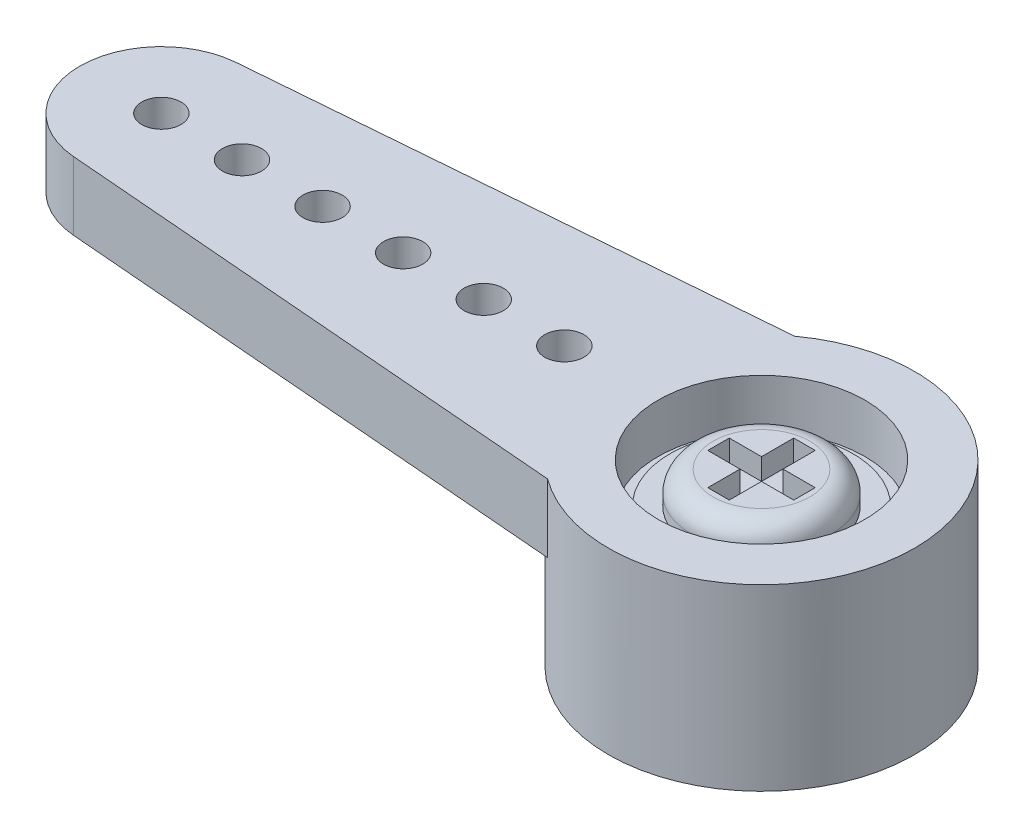
ISO-10303-21;
HEADER;
FILE_DESCRIPTION(('STEP AP214'),'2;1');
FILE_NAME('part.step','',(''),(''),'','','');
FILE_SCHEMA(('AUTOMOTIVE_DESIGN { 1 0 10303 214 1 1 1 1 }'));
ENDSEC;
DATA;
#1=APPLICATION_CONTEXT('core data for automotive mechanical design processes');
#2=APPLICATION_PROTOCOL_DEFINITION('international standard','automotive_design',2000,#1);
#3=PRODUCT_CONTEXT('',#1,'mechanical');
#4=PRODUCT('Part','Part','',(#3));
#5=PRODUCT_RELATED_PRODUCT_CATEGORY('part','',(#4));
#6=PRODUCT_DEFINITION_FORMATION('','',#4);
#7=PRODUCT_DEFINITION_CONTEXT('part definition',#1,'design');
#8=PRODUCT_DEFINITION('design','',#6,#7);
#9=PRODUCT_DEFINITION_SHAPE('','',#8);
#10=(LENGTH_UNIT() NAMED_UNIT(*) SI_UNIT(.MILLI.,.METRE.));
#11=(NAMED_UNIT(*) PLANE_ANGLE_UNIT() SI_UNIT($,.RADIAN.));
#12=(NAMED_UNIT(*) SI_UNIT($,.STERADIAN.) SOLID_ANGLE_UNIT());
#13=UNCERTAINTY_MEASURE_WITH_UNIT(LENGTH_MEASURE(1.E-05),#10,'distance_accuracy_value','');
#14=(GEOMETRIC_REPRESENTATION_CONTEXT(3) GLOBAL_UNCERTAINTY_ASSIGNED_CONTEXT((#13)) GLOBAL_UNIT_ASSIGNED_CONTEXT((#10,
#11,#12)) REPRESENTATION_CONTEXT('',''));
#15=CARTESIAN_POINT('',(0.,0.,0.));
#16=DIRECTION('',(0.,0.,1.));
#17=DIRECTION('',(1.,0.,0.));
#18=AXIS2_PLACEMENT_3D('',#15,#16,#17);
#19=CARTESIAN_POINT('',(0.,0.6604,0.));
#20=DIRECTION('',(0.,1.,0.));
#21=DIRECTION('',(0.,0.,1.));
#22=AXIS2_PLACEMENT_3D('',#19,#20,#21);
#23=PLANE('',#22);
#24=CARTESIAN_POINT('',(0.,0.6604,0.));
#25=DIRECTION('',(0.,1.,0.));
#26=DIRECTION('',(0.,0.,1.));
#27=AXIS2_PLACEMENT_3D('',#24,#25,#26);
#28=CIRCLE('',#27,2.159);
#29=CARTESIAN_POINT('',(0.,0.6604,2.159));
#30=VERTEX_POINT('',#29);
#31=EDGE_CURVE('E261',#30,#30,#28,.T.);
#32=ORIENTED_EDGE('',*,*,#31,.T.);
#33=EDGE_LOOP('',(#32));
#34=FACE_BOUND('',#33,.T.);
#35=CARTESIAN_POINT('',(0.,0.6604,0.));
#36=DIRECTION('',(0.,1.,0.));
#37=DIRECTION('',(0.,0.,1.));
#38=AXIS2_PLACEMENT_3D('',#35,#36,#37);
#39=CIRCLE('',#38,1.651);
#40=CARTESIAN_POINT('',(0.,0.6604,-1.651));
#41=VERTEX_POINT('',#40);
#42=EDGE_CURVE('E238',#41,#41,#39,.T.);
#43=ORIENTED_EDGE('',*,*,#42,.F.);
#44=EDGE_LOOP('',(#43));
#45=FACE_BOUND('',#44,.T.);
#46=ADVANCED_FACE('F31',(#34,#45),#23,.T.);
#47=CARTESIAN_POINT('',(0.,0.4572,0.));
#48=DIRECTION('',(0.,1.,0.));
#49=DIRECTION('',(0.,0.,1.));
#50=AXIS2_PLACEMENT_3D('',#47,#48,#49);
#51=PLANE('',#50);
#52=CARTESIAN_POINT('',(0.,0.4572,0.));
#53=DIRECTION('',(0.,1.,0.));
#54=DIRECTION('',(0.,0.,1.));
#55=AXIS2_PLACEMENT_3D('',#52,#53,#54);
#56=CIRCLE('',#55,2.44475);
#57=CARTESIAN_POINT('',(0.,0.4572,2.44475));
#58=VERTEX_POINT('',#57);
#59=EDGE_CURVE('E273',#58,#58,#56,.T.);
#60=ORIENTED_EDGE('',*,*,#59,.T.);
#61=EDGE_LOOP('',(#60));
#62=FACE_BOUND('',#61,.T.);
#63=CARTESIAN_POINT('',(0.,0.4572,0.));
#64=DIRECTION('',(0.,1.,0.));
#65=DIRECTION('',(0.,0.,1.));
#66=AXIS2_PLACEMENT_3D('',#63,#64,#65);
#67=CIRCLE('',#66,2.159);
#68=CARTESIAN_POINT('',(0.,0.4572,2.159));
#69=VERTEX_POINT('',#68);
#70=EDGE_CURVE('E260',#69,#69,#67,.T.);
#71=ORIENTED_EDGE('',*,*,#70,.F.);
#72=EDGE_LOOP('',(#71));
#73=FACE_BOUND('',#72,.T.);
#74=ADVANCED_FACE('F359',(#62,#73),#51,.T.);
#75=CARTESIAN_POINT('',(0.,-2.6162,0.));
#76=DIRECTION('',(0.,1.,0.));
#77=DIRECTION('',(0.,0.,1.));
#78=AXIS2_PLACEMENT_3D('',#75,#76,#77);
#79=CYLINDRICAL_SURFACE('',#78,1.27);
#80=CARTESIAN_POINT('',(0.,0.4572,0.));
#81=DIRECTION('',(0.,1.,0.));
#82=DIRECTION('',(0.,0.,1.));
#83=AXIS2_PLACEMENT_3D('',#80,#81,#82);
#84=CIRCLE('',#83,1.27);
#85=CARTESIAN_POINT('',(0.,0.4572,1.27));
#86=VERTEX_POINT('',#85);
#87=EDGE_CURVE('E276',#86,#86,#84,.F.);
#88=ORIENTED_EDGE('',*,*,#87,.F.);
#89=EDGE_LOOP('',(#88));
#90=FACE_BOUND('',#89,.T.);
#91=CARTESIAN_POINT('',(0.,-0.2794,0.));
#92=DIRECTION('',(0.,-1.,0.));
#93=DIRECTION('',(0.,0.,-1.));
#94=AXIS2_PLACEMENT_3D('',#91,#92,#93);
#95=CIRCLE('',#94,1.27);
#96=CARTESIAN_POINT('',(0.,-0.2794,-1.27));
#97=VERTEX_POINT('',#96);
#98=EDGE_CURVE('E270',#97,#97,#95,.F.);
#99=ORIENTED_EDGE('',*,*,#98,.F.);
#100=EDGE_LOOP('',(#99));
#101=FACE_BOUND('',#100,.T.);
#102=ADVANCED_FACE('F367',(#90,#101),#79,.F.);
#103=CARTESIAN_POINT('',(0.,1.6129,0.));
#104=DIRECTION('',(0.,-1.,0.));
#105=DIRECTION('',(0.,0.,-1.));
#106=AXIS2_PLACEMENT_3D('',#103,#104,#105);
#107=CYLINDRICAL_SURFACE('',#106,3.6195);
#108=DIRECTION('',(0.,-1.,0.));
#109=VECTOR('',#108,1.);
#110=CARTESIAN_POINT('',(-2.13741415032277,1.6129,2.921));
#111=LINE('',#110,#109);
#112=CARTESIAN_POINT('',(-2.13741415032277,1.6129,2.921));
#113=VERTEX_POINT('',#112);
#114=CARTESIAN_POINT('',(-2.13741415032277,0.,2.921));
#115=VERTEX_POINT('',#114);
#116=EDGE_CURVE('E315',#113,#115,#111,.T.);
#117=ORIENTED_EDGE('',*,*,#116,.T.);
#118=CARTESIAN_POINT('',(0.,0.,0.));
#119=DIRECTION('',(0.,1.,0.));
#120=DIRECTION('',(0.,0.,1.));
#121=AXIS2_PLACEMENT_3D('',#118,#119,#120);
#122=CIRCLE('',#121,3.6195);
#123=CARTESIAN_POINT('',(-2.13741415032277,0.,-2.921));
#124=VERTEX_POINT('',#123);
#125=EDGE_CURVE('E328',#124,#115,#122,.T.);
#126=ORIENTED_EDGE('',*,*,#125,.F.);
#127=DIRECTION('',(0.,-1.,0.));
#128=VECTOR('',#127,1.);
#129=CARTESIAN_POINT('',(-2.13741415032277,1.6129,-2.921));
#130=LINE('',#129,#128);
#131=CARTESIAN_POINT('',(-2.13741415032277,1.6129,-2.921));
#132=VERTEX_POINT('',#131);
#133=EDGE_CURVE('E326',#132,#124,#130,.T.);
#134=ORIENTED_EDGE('',*,*,#133,.F.);
#135=CARTESIAN_POINT('',(0.,1.6129,0.));
#136=DIRECTION('',(0.,1.,0.));
#137=DIRECTION('',(0.,0.,1.));
#138=AXIS2_PLACEMENT_3D('',#135,#136,#137);
#139=CIRCLE('',#138,3.6195);
#140=EDGE_CURVE('E308',#113,#132,#139,.T.);
#141=ORIENTED_EDGE('',*,*,#140,.F.);
#142=EDGE_LOOP('',(#117,#126,#134,#141));
#143=FACE_BOUND('',#142,.T.);
#144=CARTESIAN_POINT('',(0.,-2.6162,0.));
#145=DIRECTION('',(0.,1.,0.));
#146=DIRECTION('',(0.,0.,1.));
#147=AXIS2_PLACEMENT_3D('',#144,#145,#146);
#148=CIRCLE('',#147,3.6195);
#149=CARTESIAN_POINT('',(0.,-2.6162,3.6195));
#150=VERTEX_POINT('',#149);
#151=EDGE_CURVE('E304',#150,#150,#148,.T.);
#152=ORIENTED_EDGE('',*,*,#151,.T.);
#153=EDGE_LOOP('',(#152));
#154=FACE_BOUND('',#153,.T.);
#155=ADVANCED_FACE('F417',(#143,#154),#107,.T.);
#156=CARTESIAN_POINT('',(-14.3430596900559,1.6129,-1.92399194172469));
#157=DIRECTION('',(0.0814130180562945,0.,0.996680450541178));
#158=DIRECTION('',(0.996680450541178,0.,-0.0814130180562945));
#159=AXIS2_PLACEMENT_3D('',#156,#157,#158);
#160=PLANE('',#159);
#161=DIRECTION('',(-0.996680450541178,0.,0.0814130180562945));
#162=VECTOR('',#161,1.);
#163=CARTESIAN_POINT('',(-14.3430596900559,0.,-1.92399194172469));
#164=LINE('',#163,#162);
#165=CARTESIAN_POINT('',(-14.3430596900559,0.,-1.92399194172469));
#166=VERTEX_POINT('',#165);
#167=EDGE_CURVE('E307',#124,#166,#164,.T.);
#168=ORIENTED_EDGE('',*,*,#167,.T.);
#169=DIRECTION('',(0.,-1.,0.));
#170=VECTOR('',#169,1.);
#171=CARTESIAN_POINT('',(-14.3430596900559,1.6129,-1.92399194172469));
#172=LINE('',#171,#170);
#173=CARTESIAN_POINT('',(-14.3430596900559,1.6129,-1.92399194172469));
#174=VERTEX_POINT('',#173);
#175=EDGE_CURVE('E324',#174,#166,#172,.T.);
#176=ORIENTED_EDGE('',*,*,#175,.F.);
#177=DIRECTION('',(-0.996680450541178,0.,0.0814130180562945));
#178=VECTOR('',#177,1.);
#179=CARTESIAN_POINT('',(-14.3430596900559,1.6129,-1.92399194172469));
#180=LINE('',#179,#178);
#181=EDGE_CURVE('E82',#132,#174,#180,.T.);
#182=ORIENTED_EDGE('',*,*,#181,.F.);
#183=ORIENTED_EDGE('',*,*,#133,.T.);
#184=EDGE_LOOP('',(#168,#176,#182,#183));
#185=FACE_BOUND('',#184,.T.);
#186=ADVANCED_FACE('F441',(#185),#160,.F.);
#187=CARTESIAN_POINT('',(-14.1859,1.6129,0.));
#188=DIRECTION('',(0.,-1.,0.));
#189=DIRECTION('',(0.,0.,-1.));
#190=AXIS2_PLACEMENT_3D('',#187,#188,#189);
#191=CYLINDRICAL_SURFACE('',#190,1.9304);
#192=CARTESIAN_POINT('',(-14.1859,0.,0.));
#193=DIRECTION('',(0.,1.,0.));
#194=DIRECTION('',(0.,0.,1.));
#195=AXIS2_PLACEMENT_3D('',#192,#193,#194);
#196=CIRCLE('',#195,1.9304);
#197=CARTESIAN_POINT('',(-14.3430596900559,0.,1.92399194172469));
#198=VERTEX_POINT('',#197);
#199=EDGE_CURVE('E74',#166,#198,#196,.T.);
#200=ORIENTED_EDGE('',*,*,#199,.T.);
#201=DIRECTION('',(0.,-1.,0.));
#202=VECTOR('',#201,1.);
#203=CARTESIAN_POINT('',(-14.3430596900559,1.6129,1.92399194172469));
#204=LINE('',#203,#202);
#205=CARTESIAN_POINT('',(-14.3430596900559,1.6129,1.92399194172469));
#206=VERTEX_POINT('',#205);
#207=EDGE_CURVE('E322',#206,#198,#204,.T.);
#208=ORIENTED_EDGE('',*,*,#207,.F.);
#209=CARTESIAN_POINT('',(-14.1859,1.6129,0.));
#210=DIRECTION('',(0.,1.,0.));
#211=DIRECTION('',(0.,0.,1.));
#212=AXIS2_PLACEMENT_3D('',#209,#210,#211);
#213=CIRCLE('',#212,1.9304);
#214=EDGE_CURVE('E312',#174,#206,#213,.T.);
#215=ORIENTED_EDGE('',*,*,#214,.F.);
#216=ORIENTED_EDGE('',*,*,#175,.T.);
#217=EDGE_LOOP('',(#200,#208,#215,#216));
#218=FACE_BOUND('',#217,.T.);
#219=ADVANCED_FACE('F437',(#218),#191,.T.);
#220=CARTESIAN_POINT('',(-14.3430596900559,1.6129,1.92399194172469));
#221=DIRECTION('',(0.0814130180562943,0.,-0.996680450541178));
#222=DIRECTION('',(-0.996680450541178,0.,-0.0814130180562943));
#223=AXIS2_PLACEMENT_3D('',#220,#221,#222);
#224=PLANE('',#223);
#225=DIRECTION('',(0.996680450541178,0.,0.0814130180562943));
#226=VECTOR('',#225,1.);
#227=CARTESIAN_POINT('',(-14.3430596900559,0.,1.92399194172469));
#228=LINE('',#227,#226);
#229=EDGE_CURVE('E310',#198,#115,#228,.T.);
#230=ORIENTED_EDGE('',*,*,#229,.T.);
#231=ORIENTED_EDGE('',*,*,#116,.F.);
#232=DIRECTION('',(0.996680450541178,0.,0.0814130180562943));
#233=VECTOR('',#232,1.);
#234=CARTESIAN_POINT('',(-14.3430596900559,1.6129,1.92399194172469));
#235=LINE('',#234,#233);
#236=EDGE_CURVE('E55',#206,#113,#235,.T.);
#237=ORIENTED_EDGE('',*,*,#236,.F.);
#238=ORIENTED_EDGE('',*,*,#207,.T.);
#239=EDGE_LOOP('',(#230,#231,#237,#238));
#240=FACE_BOUND('',#239,.T.);
#241=ADVANCED_FACE('F430',(#240),#224,.F.);
#242=CARTESIAN_POINT('',(0.,1.6129,0.));
#243=DIRECTION('',(0.,1.,0.));
#244=DIRECTION('',(0.,0.,1.));
#245=AXIS2_PLACEMENT_3D('',#242,#243,#244);
#246=PLANE('',#245);
#247=CARTESIAN_POINT('',(0.,1.6129,0.));
#248=DIRECTION('',(0.,1.,0.));
#249=DIRECTION('',(0.,0.,1.));
#250=AXIS2_PLACEMENT_3D('',#247,#248,#249);
#251=CIRCLE('',#250,2.44475);
#252=CARTESIAN_POINT('',(0.,1.6129,2.44475));
#253=VERTEX_POINT('',#252);
#254=EDGE_CURVE('E277',#253,#253,#251,.T.);
#255=ORIENTED_EDGE('',*,*,#254,.F.);
#256=EDGE_LOOP('',(#255));
#257=FACE_BOUND('',#256,.T.);
#258=CARTESIAN_POINT('',(-12.2809,1.6129,0.));
#259=DIRECTION('',(0.,1.,0.));
#260=DIRECTION('',(0.,0.,1.));
#261=AXIS2_PLACEMENT_3D('',#258,#259,#260);
#262=CIRCLE('',#261,0.46355);
#263=CARTESIAN_POINT('',(-12.2809,1.6129,0.46355));
#264=VERTEX_POINT('',#263);
#265=EDGE_CURVE('E280',#264,#264,#262,.T.);
#266=ORIENTED_EDGE('',*,*,#265,.F.);
#267=EDGE_LOOP('',(#266));
#268=FACE_BOUND('',#267,.T.);
#269=CARTESIAN_POINT('',(-10.3759,1.6129,0.));
#270=DIRECTION('',(0.,1.,0.));
#271=DIRECTION('',(0.,0.,1.));
#272=AXIS2_PLACEMENT_3D('',#269,#270,#271);
#273=CIRCLE('',#272,0.46355);
#274=CARTESIAN_POINT('',(-10.3759,1.6129,0.46355));
#275=VERTEX_POINT('',#274);
#276=EDGE_CURVE('E284',#275,#275,#273,.T.);
#277=ORIENTED_EDGE('',*,*,#276,.F.);
#278=EDGE_LOOP('',(#277));
#279=FACE_BOUND('',#278,.T.);
#280=CARTESIAN_POINT('',(-8.4709,1.6129,0.));
#281=DIRECTION('',(0.,1.,0.));
#282=DIRECTION('',(0.,0.,1.));
#283=AXIS2_PLACEMENT_3D('',#280,#281,#282);
#284=CIRCLE('',#283,0.46355);
#285=CARTESIAN_POINT('',(-8.4709,1.6129,0.46355));
#286=VERTEX_POINT('',#285);
#287=EDGE_CURVE('E288',#286,#286,#284,.T.);
#288=ORIENTED_EDGE('',*,*,#287,.F.);
#289=EDGE_LOOP('',(#288));
#290=FACE_BOUND('',#289,.T.);
#291=CARTESIAN_POINT('',(-6.5659,1.6129,0.));
#292=DIRECTION('',(0.,1.,0.));
#293=DIRECTION('',(0.,0.,1.));
#294=AXIS2_PLACEMENT_3D('',#291,#292,#293);
#295=CIRCLE('',#294,0.46355);
#296=CARTESIAN_POINT('',(-6.5659,1.6129,0.46355));
#297=VERTEX_POINT('',#296);
#298=EDGE_CURVE('E292',#297,#297,#295,.T.);
#299=ORIENTED_EDGE('',*,*,#298,.F.);
#300=EDGE_LOOP('',(#299));
#301=FACE_BOUND('',#300,.T.);
#302=CARTESIAN_POINT('',(-4.6609,1.6129,0.));
#303=DIRECTION('',(0.,1.,0.));
#304=DIRECTION('',(0.,0.,1.));
#305=AXIS2_PLACEMENT_3D('',#302,#303,#304);
#306=CIRCLE('',#305,0.46355);
#307=CARTESIAN_POINT('',(-4.6609,1.6129,0.46355));
#308=VERTEX_POINT('',#307);
#309=EDGE_CURVE('E296',#308,#308,#306,.T.);
#310=ORIENTED_EDGE('',*,*,#309,.F.);
#311=EDGE_LOOP('',(#310));
#312=FACE_BOUND('',#311,.T.);
#313=CARTESIAN_POINT('',(-14.1859,1.6129,0.));
#314=DIRECTION('',(0.,1.,0.));
#315=DIRECTION('',(0.,0.,1.));
#316=AXIS2_PLACEMENT_3D('',#313,#314,#315);
#317=CIRCLE('',#316,0.46355);
#318=CARTESIAN_POINT('',(-14.1859,1.6129,0.463550000000002));
#319=VERTEX_POINT('',#318);
#320=EDGE_CURVE('E300',#319,#319,#317,.T.);
#321=ORIENTED_EDGE('',*,*,#320,.F.);
#322=EDGE_LOOP('',(#321));
#323=FACE_BOUND('',#322,.T.);
#324=ORIENTED_EDGE('',*,*,#236,.T.);
#325=ORIENTED_EDGE('',*,*,#140,.T.);
#326=ORIENTED_EDGE('',*,*,#181,.T.);
#327=ORIENTED_EDGE('',*,*,#214,.T.);
#328=EDGE_LOOP('',(#324,#325,#326,#327));
#329=FACE_BOUND('',#328,.T.);
#330=ADVANCED_FACE('F427',(#257,#268,#279,#290,#301,#312,#323,#329),#246,.T.);
#331=CARTESIAN_POINT('',(0.,0.,0.));
#332=DIRECTION('',(0.,1.,0.));
#333=DIRECTION('',(0.,0.,1.));
#334=AXIS2_PLACEMENT_3D('',#331,#332,#333);
#335=PLANE('',#334);
#336=CARTESIAN_POINT('',(-12.2809,0.,0.));
#337=DIRECTION('',(0.,1.,0.));
#338=DIRECTION('',(0.,0.,1.));
#339=AXIS2_PLACEMENT_3D('',#336,#337,#338);
#340=CIRCLE('',#339,0.46355);
#341=CARTESIAN_POINT('',(-12.2809,0.,0.46355));
#342=VERTEX_POINT('',#341);
#343=EDGE_CURVE('E283',#342,#342,#340,.T.);
#344=ORIENTED_EDGE('',*,*,#343,.T.);
#345=EDGE_LOOP('',(#344));
#346=FACE_BOUND('',#345,.T.);
#347=CARTESIAN_POINT('',(-10.3759,0.,0.));
#348=DIRECTION('',(0.,1.,0.));
#349=DIRECTION('',(0.,0.,1.));
#350=AXIS2_PLACEMENT_3D('',#347,#348,#349);
#351=CIRCLE('',#350,0.46355);
#352=CARTESIAN_POINT('',(-10.3759,0.,0.46355));
#353=VERTEX_POINT('',#352);
#354=EDGE_CURVE('E287',#353,#353,#351,.T.);
#355=ORIENTED_EDGE('',*,*,#354,.T.);
#356=EDGE_LOOP('',(#355));
#357=FACE_BOUND('',#356,.T.);
#358=CARTESIAN_POINT('',(-8.4709,0.,0.));
#359=DIRECTION('',(0.,1.,0.));
#360=DIRECTION('',(0.,0.,1.));
#361=AXIS2_PLACEMENT_3D('',#358,#359,#360);
#362=CIRCLE('',#361,0.46355);
#363=CARTESIAN_POINT('',(-8.4709,0.,0.46355));
#364=VERTEX_POINT('',#363);
#365=EDGE_CURVE('E291',#364,#364,#362,.T.);
#366=ORIENTED_EDGE('',*,*,#365,.T.);
#367=EDGE_LOOP('',(#366));
#368=FACE_BOUND('',#367,.T.);
#369=CARTESIAN_POINT('',(-6.5659,0.,0.));
#370=DIRECTION('',(0.,1.,0.));
#371=DIRECTION('',(0.,0.,1.));
#372=AXIS2_PLACEMENT_3D('',#369,#370,#371);
#373=CIRCLE('',#372,0.46355);
#374=CARTESIAN_POINT('',(-6.5659,0.,0.46355));
#375=VERTEX_POINT('',#374);
#376=EDGE_CURVE('E295',#375,#375,#373,.T.);
#377=ORIENTED_EDGE('',*,*,#376,.T.);
#378=EDGE_LOOP('',(#377));
#379=FACE_BOUND('',#378,.T.);
#380=CARTESIAN_POINT('',(-4.6609,0.,0.));
#381=DIRECTION('',(0.,1.,0.));
#382=DIRECTION('',(0.,0.,1.));
#383=AXIS2_PLACEMENT_3D('',#380,#381,#382);
#384=CIRCLE('',#383,0.46355);
#385=CARTESIAN_POINT('',(-4.6609,0.,0.46355));
#386=VERTEX_POINT('',#385);
#387=EDGE_CURVE('E299',#386,#386,#384,.T.);
#388=ORIENTED_EDGE('',*,*,#387,.T.);
#389=EDGE_LOOP('',(#388));
#390=FACE_BOUND('',#389,.T.);
#391=CARTESIAN_POINT('',(-14.1859,0.,0.));
#392=DIRECTION('',(0.,1.,0.));
#393=DIRECTION('',(0.,0.,1.));
#394=AXIS2_PLACEMENT_3D('',#391,#392,#393);
#395=CIRCLE('',#394,0.46355);
#396=CARTESIAN_POINT('',(-14.1859,0.,0.463550000000002));
#397=VERTEX_POINT('',#396);
#398=EDGE_CURVE('E303',#397,#397,#395,.T.);
#399=ORIENTED_EDGE('',*,*,#398,.T.);
#400=EDGE_LOOP('',(#399));
#401=FACE_BOUND('',#400,.T.);
#402=ORIENTED_EDGE('',*,*,#167,.F.);
#403=ORIENTED_EDGE('',*,*,#125,.T.);
#404=ORIENTED_EDGE('',*,*,#229,.F.);
#405=ORIENTED_EDGE('',*,*,#199,.F.);
#406=EDGE_LOOP('',(#402,#403,#404,#405));
#407=FACE_BOUND('',#406,.T.);
#408=ADVANCED_FACE('F425',(#346,#357,#368,#379,#390,#401,#407),#335,.F.);
#409=CARTESIAN_POINT('',(0.,-2.6162,0.));
#410=DIRECTION('',(0.,1.,0.));
#411=DIRECTION('',(0.,0.,1.));
#412=AXIS2_PLACEMENT_3D('',#409,#410,#411);
#413=PLANE('',#412);
#414=CARTESIAN_POINT('',(0.,-2.6162,0.));
#415=DIRECTION('',(0.,-1.,0.));
#416=DIRECTION('',(0.,0.,-1.));
#417=AXIS2_PLACEMENT_3D('',#414,#415,#416);
#418=CIRCLE('',#417,2.286);
#419=CARTESIAN_POINT('',(0.,-2.6162,-2.286));
#420=VERTEX_POINT('',#419);
#421=EDGE_CURVE('E264',#420,#420,#418,.T.);
#422=ORIENTED_EDGE('',*,*,#421,.F.);
#423=EDGE_LOOP('',(#422));
#424=FACE_BOUND('',#423,.T.);
#425=ORIENTED_EDGE('',*,*,#151,.F.);
#426=EDGE_LOOP('',(#425));
#427=FACE_BOUND('',#426,.T.);
#428=ADVANCED_FACE('F421',(#424,#427),#413,.F.);
#429=CARTESIAN_POINT('',(-14.1859,-2.6162,0.));
#430=DIRECTION('',(0.,1.,0.));
#431=DIRECTION('',(0.,0.,1.));
#432=AXIS2_PLACEMENT_3D('',#429,#430,#431);
#433=CYLINDRICAL_SURFACE('',#432,0.46355);
#434=ORIENTED_EDGE('',*,*,#320,.T.);
#435=EDGE_LOOP('',(#434));
#436=FACE_BOUND('',#435,.T.);
#437=ORIENTED_EDGE('',*,*,#398,.F.);
#438=EDGE_LOOP('',(#437));
#439=FACE_BOUND('',#438,.T.);
#440=ADVANCED_FACE('F413',(#436,#439),#433,.F.);
#441=CARTESIAN_POINT('',(-4.6609,-2.6162,0.));
#442=DIRECTION('',(0.,1.,0.));
#443=DIRECTION('',(0.,0.,1.));
#444=AXIS2_PLACEMENT_3D('',#441,#442,#443);
#445=CYLINDRICAL_SURFACE('',#444,0.46355);
#446=ORIENTED_EDGE('',*,*,#309,.T.);
#447=EDGE_LOOP('',(#446));
#448=FACE_BOUND('',#447,.T.);
#449=ORIENTED_EDGE('',*,*,#387,.F.);
#450=EDGE_LOOP('',(#449));
#451=FACE_BOUND('',#450,.T.);
#452=ADVANCED_FACE('F409',(#448,#451),#445,.F.);
#453=CARTESIAN_POINT('',(-6.5659,-2.6162,0.));
#454=DIRECTION('',(0.,1.,0.));
#455=DIRECTION('',(0.,0.,1.));
#456=AXIS2_PLACEMENT_3D('',#453,#454,#455);
#457=CYLINDRICAL_SURFACE('',#456,0.46355);
#458=ORIENTED_EDGE('',*,*,#298,.T.);
#459=EDGE_LOOP('',(#458));
#460=FACE_BOUND('',#459,.T.);
#461=ORIENTED_EDGE('',*,*,#376,.F.);
#462=EDGE_LOOP('',(#461));
#463=FACE_BOUND('',#462,.T.);
#464=ADVANCED_FACE('F405',(#460,#463),#457,.F.);
#465=CARTESIAN_POINT('',(-8.4709,-2.6162,0.));
#466=DIRECTION('',(0.,1.,0.));
#467=DIRECTION('',(0.,0.,1.));
#468=AXIS2_PLACEMENT_3D('',#465,#466,#467);
#469=CYLINDRICAL_SURFACE('',#468,0.46355);
#470=ORIENTED_EDGE('',*,*,#287,.T.);
#471=EDGE_LOOP('',(#470));
#472=FACE_BOUND('',#471,.T.);
#473=ORIENTED_EDGE('',*,*,#365,.F.);
#474=EDGE_LOOP('',(#473));
#475=FACE_BOUND('',#474,.T.);
#476=ADVANCED_FACE('F401',(#472,#475),#469,.F.);
#477=CARTESIAN_POINT('',(-10.3759,-2.6162,0.));
#478=DIRECTION('',(0.,1.,0.));
#479=DIRECTION('',(0.,0.,1.));
#480=AXIS2_PLACEMENT_3D('',#477,#478,#479);
#481=CYLINDRICAL_SURFACE('',#480,0.46355);
#482=ORIENTED_EDGE('',*,*,#276,.T.);
#483=EDGE_LOOP('',(#482));
#484=FACE_BOUND('',#483,.T.);
#485=ORIENTED_EDGE('',*,*,#354,.F.);
#486=EDGE_LOOP('',(#485));
#487=FACE_BOUND('',#486,.T.);
#488=ADVANCED_FACE('F397',(#484,#487),#481,.F.);
#489=CARTESIAN_POINT('',(-12.2809,-2.6162,0.));
#490=DIRECTION('',(0.,1.,0.));
#491=DIRECTION('',(0.,0.,1.));
#492=AXIS2_PLACEMENT_3D('',#489,#490,#491);
#493=CYLINDRICAL_SURFACE('',#492,0.46355);
#494=ORIENTED_EDGE('',*,*,#265,.T.);
#495=EDGE_LOOP('',(#494));
#496=FACE_BOUND('',#495,.T.);
#497=ORIENTED_EDGE('',*,*,#343,.F.);
#498=EDGE_LOOP('',(#497));
#499=FACE_BOUND('',#498,.T.);
#500=ADVANCED_FACE('F393',(#496,#499),#493,.F.);
#501=CARTESIAN_POINT('',(0.,0.4572,0.));
#502=DIRECTION('',(0.,1.,0.));
#503=DIRECTION('',(0.,0.,1.));
#504=AXIS2_PLACEMENT_3D('',#501,#502,#503);
#505=CYLINDRICAL_SURFACE('',#504,2.44475);
#506=ORIENTED_EDGE('',*,*,#59,.F.);
#507=EDGE_LOOP('',(#506));
#508=FACE_BOUND('',#507,.T.);
#509=ORIENTED_EDGE('',*,*,#254,.T.);
#510=EDGE_LOOP('',(#509));
#511=FACE_BOUND('',#510,.T.);
#512=ADVANCED_FACE('F386',(#508,#511),#505,.F.);
#513=CARTESIAN_POINT('',(0.,-0.2794,0.));
#514=DIRECTION('',(0.,-1.,0.));
#515=DIRECTION('',(0.,0.,-1.));
#516=AXIS2_PLACEMENT_3D('',#513,#514,#515);
#517=PLANE('',#516);
#518=CARTESIAN_POINT('',(0.,-0.2794,0.));
#519=DIRECTION('',(0.,-1.,0.));
#520=DIRECTION('',(0.,0.,-1.));
#521=AXIS2_PLACEMENT_3D('',#518,#519,#520);
#522=CIRCLE('',#521,2.286);
#523=CARTESIAN_POINT('',(0.,-0.2794,-2.286));
#524=VERTEX_POINT('',#523);
#525=EDGE_CURVE('E267',#524,#524,#522,.T.);
#526=ORIENTED_EDGE('',*,*,#525,.T.);
#527=EDGE_LOOP('',(#526));
#528=FACE_BOUND('',#527,.T.);
#529=ORIENTED_EDGE('',*,*,#98,.T.);
#530=EDGE_LOOP('',(#529));
#531=FACE_BOUND('',#530,.T.);
#532=ADVANCED_FACE('F383',(#528,#531),#517,.T.);
#533=CARTESIAN_POINT('',(0.,-0.2794,0.));
#534=DIRECTION('',(0.,-1.,0.));
#535=DIRECTION('',(0.,0.,-1.));
#536=AXIS2_PLACEMENT_3D('',#533,#534,#535);
#537=CYLINDRICAL_SURFACE('',#536,2.286);
#538=ORIENTED_EDGE('',*,*,#525,.F.);
#539=EDGE_LOOP('',(#538));
#540=FACE_BOUND('',#539,.T.);
#541=ORIENTED_EDGE('',*,*,#421,.T.);
#542=EDGE_LOOP('',(#541));
#543=FACE_BOUND('',#542,.T.);
#544=ADVANCED_FACE('F381',(#540,#543),#537,.F.);
#545=CARTESIAN_POINT('',(0.,0.6604,0.));
#546=DIRECTION('',(0.,-1.,0.));
#547=DIRECTION('',(0.,0.,-1.));
#548=AXIS2_PLACEMENT_3D('',#545,#546,#547);
#549=CYLINDRICAL_SURFACE('',#548,2.159);
#550=ORIENTED_EDGE('',*,*,#31,.F.);
#551=EDGE_LOOP('',(#550));
#552=FACE_BOUND('',#551,.T.);
#553=ORIENTED_EDGE('',*,*,#70,.T.);
#554=EDGE_LOOP('',(#553));
#555=FACE_BOUND('',#554,.T.);
#556=ADVANCED_FACE('F378',(#552,#555),#549,.T.);
#557=CARTESIAN_POINT('',(0.,0.4572,0.));
#558=DIRECTION('',(0.,1.,0.));
#559=DIRECTION('',(0.,0.,1.));
#560=AXIS2_PLACEMENT_3D('',#557,#558,#559);
#561=PLANE('',#560);
#562=ORIENTED_EDGE('',*,*,#87,.T.);
#563=EDGE_LOOP('',(#562));
#564=FACE_BOUND('',#563,.T.);
#565=ADVANCED_FACE('F375',(#564),#561,.F.);
#566=CARTESIAN_POINT('',(0.,1.4224,0.));
#567=DIRECTION('',(0.,-1.,0.));
#568=DIRECTION('',(0.,0.,-1.));
#569=AXIS2_PLACEMENT_3D('',#566,#567,#568);
#570=CYLINDRICAL_SURFACE('',#569,1.651);
#571=CARTESIAN_POINT('',(0.,0.9144,0.));
#572=DIRECTION('',(0.,1.,0.));
#573=DIRECTION('',(0.,0.,1.));
#574=AXIS2_PLACEMENT_3D('',#571,#572,#573);
#575=CIRCLE('',#574,1.651);
#576=CARTESIAN_POINT('',(0.,0.9144,-1.651));
#577=VERTEX_POINT('',#576);
#578=EDGE_CURVE('E11',#577,#577,#575,.F.);
#579=CARTESIAN_POINT('',(0.,0.9144,-1.651));
#580=CARTESIAN_POINT('',(0.,0.911754166666666,-1.651));
#581=CARTESIAN_POINT('',(0.,0.909108333333333,-1.651));
#582=CARTESIAN_POINT('',(0.,0.903816666666666,-1.651));
#583=CARTESIAN_POINT('',(0.,0.901170833333333,-1.651));
#584=CARTESIAN_POINT('',(0.,0.895879166666666,-1.651));
#585=CARTESIAN_POINT('',(0.,0.893233333333333,-1.651));
#586=CARTESIAN_POINT('',(0.,0.887941666666667,-1.651));
#587=CARTESIAN_POINT('',(0.,0.885295833333333,-1.651));
#588=CARTESIAN_POINT('',(0.,0.880004166666666,-1.651));
#589=CARTESIAN_POINT('',(0.,0.877358333333333,-1.651));
#590=CARTESIAN_POINT('',(0.,0.872066666666666,-1.651));
#591=CARTESIAN_POINT('',(0.,0.869420833333333,-1.651));
#592=CARTESIAN_POINT('',(0.,0.864129166666667,-1.651));
#593=CARTESIAN_POINT('',(0.,0.861483333333333,-1.651));
#594=CARTESIAN_POINT('',(0.,0.856191666666666,-1.651));
#595=CARTESIAN_POINT('',(0.,0.853545833333333,-1.651));
#596=CARTESIAN_POINT('',(0.,0.848254166666666,-1.651));
#597=CARTESIAN_POINT('',(0.,0.845608333333333,-1.651));
#598=CARTESIAN_POINT('',(0.,0.840316666666666,-1.651));
#599=CARTESIAN_POINT('',(0.,0.837670833333333,-1.651));
#600=CARTESIAN_POINT('',(0.,0.832379166666666,-1.651));
#601=CARTESIAN_POINT('',(0.,0.829733333333333,-1.651));
#602=CARTESIAN_POINT('',(0.,0.824441666666667,-1.651));
#603=CARTESIAN_POINT('',(0.,0.821795833333333,-1.651));
#604=CARTESIAN_POINT('',(0.,0.816504166666666,-1.651));
#605=CARTESIAN_POINT('',(0.,0.813858333333333,-1.651));
#606=CARTESIAN_POINT('',(0.,0.808566666666666,-1.651));
#607=CARTESIAN_POINT('',(0.,0.805920833333333,-1.651));
#608=CARTESIAN_POINT('',(0.,0.800629166666667,-1.651));
#609=CARTESIAN_POINT('',(0.,0.797983333333333,-1.651));
#610=CARTESIAN_POINT('',(0.,0.792691666666667,-1.651));
#611=CARTESIAN_POINT('',(0.,0.790045833333333,-1.651));
#612=CARTESIAN_POINT('',(0.,0.784754166666667,-1.651));
#613=CARTESIAN_POINT('',(0.,0.782108333333333,-1.651));
#614=CARTESIAN_POINT('',(0.,0.776816666666666,-1.651));
#615=CARTESIAN_POINT('',(0.,0.774170833333333,-1.651));
#616=CARTESIAN_POINT('',(0.,0.768879166666666,-1.651));
#617=CARTESIAN_POINT('',(0.,0.766233333333333,-1.651));
#618=CARTESIAN_POINT('',(0.,0.760941666666667,-1.651));
#619=CARTESIAN_POINT('',(0.,0.758295833333333,-1.651));
#620=CARTESIAN_POINT('',(0.,0.753004166666666,-1.651));
#621=CARTESIAN_POINT('',(0.,0.750358333333333,-1.651));
#622=CARTESIAN_POINT('',(0.,0.745066666666667,-1.651));
#623=CARTESIAN_POINT('',(0.,0.742420833333333,-1.651));
#624=CARTESIAN_POINT('',(0.,0.737129166666667,-1.651));
#625=CARTESIAN_POINT('',(0.,0.734483333333333,-1.651));
#626=CARTESIAN_POINT('',(0.,0.729191666666667,-1.651));
#627=CARTESIAN_POINT('',(0.,0.726545833333333,-1.651));
#628=CARTESIAN_POINT('',(0.,0.721254166666667,-1.651));
#629=CARTESIAN_POINT('',(0.,0.718608333333333,-1.651));
#630=CARTESIAN_POINT('',(0.,0.713316666666666,-1.651));
#631=CARTESIAN_POINT('',(0.,0.710670833333333,-1.651));
#632=CARTESIAN_POINT('',(0.,0.705379166666666,-1.651));
#633=CARTESIAN_POINT('',(0.,0.702733333333333,-1.651));
#634=CARTESIAN_POINT('',(0.,0.697441666666667,-1.651));
#635=CARTESIAN_POINT('',(0.,0.694795833333333,-1.651));
#636=CARTESIAN_POINT('',(0.,0.689504166666667,-1.651));
#637=CARTESIAN_POINT('',(0.,0.686858333333333,-1.651));
#638=CARTESIAN_POINT('',(0.,0.681566666666667,-1.651));
#639=CARTESIAN_POINT('',(0.,0.678920833333333,-1.651));
#640=CARTESIAN_POINT('',(0.,0.673629166666667,-1.651));
#641=CARTESIAN_POINT('',(0.,0.670983333333333,-1.651));
#642=CARTESIAN_POINT('',(0.,0.665691666666667,-1.651));
#643=CARTESIAN_POINT('',(0.,0.663045833333333,-1.651));
#644=CARTESIAN_POINT('',(0.,0.6604,-1.651));
#645=B_SPLINE_CURVE_WITH_KNOTS('',3,(#579,#580,#581,#582,#583,#584,#585,#586,#587,#588,#589,
#590,#591,#592,#593,#594,#595,#596,#597,#598,#599,#600,#601,#602,#603,#604,#605,#606,#607,#608,
#609,#610,#611,#612,#613,#614,#615,#616,#617,#618,#619,#620,#621,#622,#623,#624,#625,#626,#627,
#628,#629,#630,#631,#632,#633,#634,#635,#636,#637,#638,#639,#640,#641,#642,#643,#644),
.UNSPECIFIED.,.F.,.F.,(4,2,2,2,2,2,2,2,2,2,2,2,2,2,2,2,2,2,2,2,2,2,2,2,2,2,2,2,2,2,2,2,4),(0.,
0.00793750000000002,0.015875,0.0238125,0.03175,0.0396875,0.0476249999999999,0.0555624999999999,
0.0635,0.0714375,0.079375,0.0873124999999999,0.09525,0.1031875,0.111125,0.1190625,0.127,
0.1349375,0.142875,0.1508125,0.15875,0.1666875,0.174625,0.1825625,0.1905,0.1984375,0.206375,
0.2143125,0.22225,0.2301875,0.238125,0.2460625,0.254),.UNSPECIFIED.);
#646=EDGE_CURVE('BSEAM373',#577,#41,#645,.T.);
#647=ORIENTED_EDGE('',*,*,#578,.T.);
#648=ORIENTED_EDGE('',*,*,#42,.T.);
#649=ORIENTED_EDGE('',*,*,#646,.T.);
#650=ORIENTED_EDGE('',*,*,#646,.F.);
#651=EDGE_LOOP('',(#647,#649,#648,#650));
#652=FACE_BOUND('',#651,.T.);
#653=ADVANCED_FACE('F373',(#652),#570,.T.);
#654=CARTESIAN_POINT('',(0.,1.4224,0.));
#655=DIRECTION('',(0.,1.,0.));
#656=DIRECTION('',(0.,0.,1.));
#657=AXIS2_PLACEMENT_3D('',#654,#655,#656);
#658=PLANE('',#657);
#659=CARTESIAN_POINT('',(0.,1.4224,0.));
#660=DIRECTION('',(0.,1.,0.));
#661=DIRECTION('',(0.,0.,1.));
#662=AXIS2_PLACEMENT_3D('',#659,#660,#661);
#663=CIRCLE('',#662,1.143);
#664=CARTESIAN_POINT('',(0.,1.4224,1.143));
#665=VERTEX_POINT('',#664);
#666=EDGE_CURVE('E39',#665,#665,#663,.T.);
#667=ORIENTED_EDGE('',*,*,#666,.T.);
#668=EDGE_LOOP('',(#667));
#669=FACE_BOUND('',#668,.T.);
#670=DIRECTION('',(1.,0.,0.));
#671=VECTOR('',#670,1.);
#672=CARTESIAN_POINT('',(0.254,1.4224,0.254));
#673=LINE('',#672,#671);
#674=CARTESIAN_POINT('',(0.254,1.4224,0.254));
#675=VERTEX_POINT('',#674);
#676=CARTESIAN_POINT('',(1.016,1.4224,0.254000000000001));
#677=VERTEX_POINT('',#676);
#678=EDGE_CURVE('E46',#675,#677,#673,.T.);
#679=ORIENTED_EDGE('',*,*,#678,.F.);
#680=DIRECTION('',(0.,0.,-1.));
#681=VECTOR('',#680,1.);
#682=CARTESIAN_POINT('',(0.254,1.4224,1.016));
#683=LINE('',#682,#681);
#684=CARTESIAN_POINT('',(0.254,1.4224,1.016));
#685=VERTEX_POINT('',#684);
#686=EDGE_CURVE('E176',#685,#675,#683,.T.);
#687=ORIENTED_EDGE('',*,*,#686,.F.);
#688=DIRECTION('',(1.,0.,0.));
#689=VECTOR('',#688,1.);
#690=CARTESIAN_POINT('',(0.254,1.4224,1.016));
#691=LINE('',#690,#689);
#692=CARTESIAN_POINT('',(-0.254,1.4224,1.016));
#693=VERTEX_POINT('',#692);
#694=EDGE_CURVE('E179',#693,#685,#691,.T.);
#695=ORIENTED_EDGE('',*,*,#694,.F.);
#696=DIRECTION('',(0.,0.,1.));
#697=VECTOR('',#696,1.);
#698=CARTESIAN_POINT('',(-0.254,1.4224,1.016));
#699=LINE('',#698,#697);
#700=CARTESIAN_POINT('',(-0.254,1.4224,0.254));
#701=VERTEX_POINT('',#700);
#702=EDGE_CURVE('E231',#701,#693,#699,.T.);
#703=ORIENTED_EDGE('',*,*,#702,.F.);
#704=DIRECTION('',(1.,0.,0.));
#705=VECTOR('',#704,1.);
#706=CARTESIAN_POINT('',(-0.254,1.4224,0.254));
#707=LINE('',#706,#705);
#708=CARTESIAN_POINT('',(-1.016,1.4224,0.254));
#709=VERTEX_POINT('',#708);
#710=EDGE_CURVE('E228',#709,#701,#707,.T.);
#711=ORIENTED_EDGE('',*,*,#710,.F.);
#712=DIRECTION('',(0.,0.,1.));
#713=VECTOR('',#712,1.);
#714=CARTESIAN_POINT('',(-1.016,1.4224,0.254));
#715=LINE('',#714,#713);
#716=CARTESIAN_POINT('',(-1.016,1.4224,-0.254000000000001));
#717=VERTEX_POINT('',#716);
#718=EDGE_CURVE('E225',#717,#709,#715,.T.);
#719=ORIENTED_EDGE('',*,*,#718,.F.);
#720=DIRECTION('',(-1.,0.,0.));
#721=VECTOR('',#720,1.);
#722=CARTESIAN_POINT('',(-0.254,1.4224,-0.254));
#723=LINE('',#722,#721);
#724=CARTESIAN_POINT('',(-0.254,1.4224,-0.254));
#725=VERTEX_POINT('',#724);
#726=EDGE_CURVE('E222',#725,#717,#723,.T.);
#727=ORIENTED_EDGE('',*,*,#726,.F.);
#728=DIRECTION('',(0.,0.,1.));
#729=VECTOR('',#728,1.);
#730=CARTESIAN_POINT('',(-0.254000000000001,1.4224,-1.016));
#731=LINE('',#730,#729);
#732=CARTESIAN_POINT('',(-0.254000000000001,1.4224,-1.016));
#733=VERTEX_POINT('',#732);
#734=EDGE_CURVE('E219',#733,#725,#731,.T.);
#735=ORIENTED_EDGE('',*,*,#734,.F.);
#736=DIRECTION('',(-1.,0.,0.));
#737=VECTOR('',#736,1.);
#738=CARTESIAN_POINT('',(0.254,1.4224,-1.016));
#739=LINE('',#738,#737);
#740=CARTESIAN_POINT('',(0.254,1.4224,-1.016));
#741=VERTEX_POINT('',#740);
#742=EDGE_CURVE('E216',#741,#733,#739,.T.);
#743=ORIENTED_EDGE('',*,*,#742,.F.);
#744=DIRECTION('',(0.,0.,-1.));
#745=VECTOR('',#744,1.);
#746=CARTESIAN_POINT('',(0.254,1.4224,-1.016));
#747=LINE('',#746,#745);
#748=CARTESIAN_POINT('',(0.254,1.4224,-0.254));
#749=VERTEX_POINT('',#748);
#750=EDGE_CURVE('E213',#749,#741,#747,.T.);
#751=ORIENTED_EDGE('',*,*,#750,.F.);
#752=DIRECTION('',(-1.,0.,0.));
#753=VECTOR('',#752,1.);
#754=CARTESIAN_POINT('',(0.254,1.4224,-0.254));
#755=LINE('',#754,#753);
#756=CARTESIAN_POINT('',(1.016,1.4224,-0.254000000000001));
#757=VERTEX_POINT('',#756);
#758=EDGE_CURVE('E210',#757,#749,#755,.T.);
#759=ORIENTED_EDGE('',*,*,#758,.F.);
#760=DIRECTION('',(0.,0.,-1.));
#761=VECTOR('',#760,1.);
#762=CARTESIAN_POINT('',(1.016,1.4224,0.254000000000001));
#763=LINE('',#762,#761);
#764=EDGE_CURVE('E208',#677,#757,#763,.T.);
#765=ORIENTED_EDGE('',*,*,#764,.F.);
#766=EDGE_LOOP('',(#679,#687,#695,#703,#711,#719,#727,#735,#743,#751,#759,#765));
#767=FACE_BOUND('',#766,.T.);
#768=ADVANCED_FACE('F348',(#669,#767),#658,.T.);
#769=CARTESIAN_POINT('',(0.254,0.9144,0.254));
#770=DIRECTION('',(0.,0.,1.));
#771=DIRECTION('',(1.,0.,0.));
#772=AXIS2_PLACEMENT_3D('',#769,#770,#771);
#773=PLANE('',#772);
#774=ORIENTED_EDGE('',*,*,#678,.T.);
#775=DIRECTION('',(0.,1.,0.));
#776=VECTOR('',#775,1.);
#777=CARTESIAN_POINT('',(1.016,0.9144,0.254000000000001));
#778=LINE('',#777,#776);
#779=CARTESIAN_POINT('',(1.016,0.9144,0.254000000000001));
#780=VERTEX_POINT('',#779);
#781=EDGE_CURVE('E153',#780,#677,#778,.T.);
#782=ORIENTED_EDGE('',*,*,#781,.F.);
#783=DIRECTION('',(1.,0.,0.));
#784=VECTOR('',#783,1.);
#785=CARTESIAN_POINT('',(0.254,0.9144,0.254));
#786=LINE('',#785,#784);
#787=CARTESIAN_POINT('',(0.254,0.9144,0.254));
#788=VERTEX_POINT('',#787);
#789=EDGE_CURVE('E157',#788,#780,#786,.T.);
#790=ORIENTED_EDGE('',*,*,#789,.F.);
#791=DIRECTION('',(0.,1.,0.));
#792=VECTOR('',#791,1.);
#793=CARTESIAN_POINT('',(0.254,0.9144,0.254));
#794=LINE('',#793,#792);
#795=EDGE_CURVE('E236',#788,#675,#794,.T.);
#796=ORIENTED_EDGE('',*,*,#795,.T.);
#797=EDGE_LOOP('',(#774,#782,#790,#796));
#798=FACE_BOUND('',#797,.T.);
#799=ADVANCED_FACE('F155',(#798),#773,.F.);
#800=CARTESIAN_POINT('',(0.254,0.9144,1.016));
#801=DIRECTION('',(1.,0.,0.));
#802=DIRECTION('',(0.,0.,-1.));
#803=AXIS2_PLACEMENT_3D('',#800,#801,#802);
#804=PLANE('',#803);
#805=ORIENTED_EDGE('',*,*,#686,.T.);
#806=ORIENTED_EDGE('',*,*,#795,.F.);
#807=DIRECTION('',(0.,0.,-1.));
#808=VECTOR('',#807,1.);
#809=CARTESIAN_POINT('',(0.254,0.9144,1.016));
#810=LINE('',#809,#808);
#811=CARTESIAN_POINT('',(0.254,0.9144,1.016));
#812=VERTEX_POINT('',#811);
#813=EDGE_CURVE('E163',#812,#788,#810,.T.);
#814=ORIENTED_EDGE('',*,*,#813,.F.);
#815=DIRECTION('',(0.,1.,0.));
#816=VECTOR('',#815,1.);
#817=CARTESIAN_POINT('',(0.254,0.9144,1.016));
#818=LINE('',#817,#816);
#819=EDGE_CURVE('E239',#812,#685,#818,.T.);
#820=ORIENTED_EDGE('',*,*,#819,.T.);
#821=EDGE_LOOP('',(#805,#806,#814,#820));
#822=FACE_BOUND('',#821,.T.);
#823=ADVANCED_FACE('F561',(#822),#804,.F.);
#824=CARTESIAN_POINT('',(0.254,0.9144,1.016));
#825=DIRECTION('',(0.,0.,1.));
#826=DIRECTION('',(1.,0.,0.));
#827=AXIS2_PLACEMENT_3D('',#824,#825,#826);
#828=PLANE('',#827);
#829=ORIENTED_EDGE('',*,*,#694,.T.);
#830=ORIENTED_EDGE('',*,*,#819,.F.);
#831=DIRECTION('',(1.,0.,0.));
#832=VECTOR('',#831,1.);
#833=CARTESIAN_POINT('',(0.254,0.9144,1.016));
#834=LINE('',#833,#832);
#835=CARTESIAN_POINT('',(-0.254,0.9144,1.016));
#836=VERTEX_POINT('',#835);
#837=EDGE_CURVE('E204',#836,#812,#834,.T.);
#838=ORIENTED_EDGE('',*,*,#837,.F.);
#839=DIRECTION('',(0.,1.,0.));
#840=VECTOR('',#839,1.);
#841=CARTESIAN_POINT('',(-0.254,0.9144,1.016));
#842=LINE('',#841,#840);
#843=EDGE_CURVE('E241',#836,#693,#842,.T.);
#844=ORIENTED_EDGE('',*,*,#843,.T.);
#845=EDGE_LOOP('',(#829,#830,#838,#844));
#846=FACE_BOUND('',#845,.T.);
#847=ADVANCED_FACE('F569',(#846),#828,.F.);
#848=CARTESIAN_POINT('',(-0.254,0.9144,1.016));
#849=DIRECTION('',(-1.,0.,0.));
#850=DIRECTION('',(0.,0.,1.));
#851=AXIS2_PLACEMENT_3D('',#848,#849,#850);
#852=PLANE('',#851);
#853=ORIENTED_EDGE('',*,*,#702,.T.);
#854=ORIENTED_EDGE('',*,*,#843,.F.);
#855=DIRECTION('',(0.,0.,1.));
#856=VECTOR('',#855,1.);
#857=CARTESIAN_POINT('',(-0.254,0.9144,1.016));
#858=LINE('',#857,#856);
#859=CARTESIAN_POINT('',(-0.254,0.9144,0.254));
#860=VERTEX_POINT('',#859);
#861=EDGE_CURVE('E201',#860,#836,#858,.T.);
#862=ORIENTED_EDGE('',*,*,#861,.F.);
#863=DIRECTION('',(0.,1.,0.));
#864=VECTOR('',#863,1.);
#865=CARTESIAN_POINT('',(-0.254,0.9144,0.254));
#866=LINE('',#865,#864);
#867=EDGE_CURVE('E243',#860,#701,#866,.T.);
#868=ORIENTED_EDGE('',*,*,#867,.T.);
#869=EDGE_LOOP('',(#853,#854,#862,#868));
#870=FACE_BOUND('',#869,.T.);
#871=ADVANCED_FACE('F578',(#870),#852,.F.);
#872=CARTESIAN_POINT('',(-0.254,0.9144,0.254));
#873=DIRECTION('',(0.,0.,1.));
#874=DIRECTION('',(1.,0.,0.));
#875=AXIS2_PLACEMENT_3D('',#872,#873,#874);
#876=PLANE('',#875);
#877=ORIENTED_EDGE('',*,*,#710,.T.);
#878=ORIENTED_EDGE('',*,*,#867,.F.);
#879=DIRECTION('',(1.,0.,0.));
#880=VECTOR('',#879,1.);
#881=CARTESIAN_POINT('',(-0.254,0.9144,0.254));
#882=LINE('',#881,#880);
#883=CARTESIAN_POINT('',(-1.016,0.9144,0.254));
#884=VERTEX_POINT('',#883);
#885=EDGE_CURVE('E198',#884,#860,#882,.T.);
#886=ORIENTED_EDGE('',*,*,#885,.F.);
#887=DIRECTION('',(0.,1.,0.));
#888=VECTOR('',#887,1.);
#889=CARTESIAN_POINT('',(-1.016,0.9144,0.254));
#890=LINE('',#889,#888);
#891=EDGE_CURVE('E245',#884,#709,#890,.T.);
#892=ORIENTED_EDGE('',*,*,#891,.T.);
#893=EDGE_LOOP('',(#877,#878,#886,#892));
#894=FACE_BOUND('',#893,.T.);
#895=ADVANCED_FACE('F587',(#894),#876,.F.);
#896=CARTESIAN_POINT('',(-1.016,0.9144,0.254));
#897=DIRECTION('',(-1.,0.,0.));
#898=DIRECTION('',(0.,0.,1.));
#899=AXIS2_PLACEMENT_3D('',#896,#897,#898);
#900=PLANE('',#899);
#901=ORIENTED_EDGE('',*,*,#718,.T.);
#902=ORIENTED_EDGE('',*,*,#891,.F.);
#903=DIRECTION('',(0.,0.,1.));
#904=VECTOR('',#903,1.);
#905=CARTESIAN_POINT('',(-1.016,0.9144,0.254));
#906=LINE('',#905,#904);
#907=CARTESIAN_POINT('',(-1.016,0.9144,-0.254000000000001));
#908=VERTEX_POINT('',#907);
#909=EDGE_CURVE('E195',#908,#884,#906,.T.);
#910=ORIENTED_EDGE('',*,*,#909,.F.);
#911=DIRECTION('',(0.,1.,0.));
#912=VECTOR('',#911,1.);
#913=CARTESIAN_POINT('',(-1.016,0.9144,-0.254000000000001));
#914=LINE('',#913,#912);
#915=EDGE_CURVE('E247',#908,#717,#914,.T.);
#916=ORIENTED_EDGE('',*,*,#915,.T.);
#917=EDGE_LOOP('',(#901,#902,#910,#916));
#918=FACE_BOUND('',#917,.T.);
#919=ADVANCED_FACE('F596',(#918),#900,.F.);
#920=CARTESIAN_POINT('',(-0.254,0.9144,-0.254));
#921=DIRECTION('',(0.,0.,-1.));
#922=DIRECTION('',(-1.,0.,0.));
#923=AXIS2_PLACEMENT_3D('',#920,#921,#922);
#924=PLANE('',#923);
#925=ORIENTED_EDGE('',*,*,#726,.T.);
#926=ORIENTED_EDGE('',*,*,#915,.F.);
#927=DIRECTION('',(-1.,0.,0.));
#928=VECTOR('',#927,1.);
#929=CARTESIAN_POINT('',(-0.254,0.9144,-0.254));
#930=LINE('',#929,#928);
#931=CARTESIAN_POINT('',(-0.254,0.9144,-0.254));
#932=VERTEX_POINT('',#931);
#933=EDGE_CURVE('E192',#932,#908,#930,.T.);
#934=ORIENTED_EDGE('',*,*,#933,.F.);
#935=DIRECTION('',(0.,1.,0.));
#936=VECTOR('',#935,1.);
#937=CARTESIAN_POINT('',(-0.254,0.9144,-0.254));
#938=LINE('',#937,#936);
#939=EDGE_CURVE('E249',#932,#725,#938,.T.);
#940=ORIENTED_EDGE('',*,*,#939,.T.);
#941=EDGE_LOOP('',(#925,#926,#934,#940));
#942=FACE_BOUND('',#941,.T.);
#943=ADVANCED_FACE('F605',(#942),#924,.F.);
#944=CARTESIAN_POINT('',(-0.254000000000001,0.9144,-1.016));
#945=DIRECTION('',(-1.,0.,0.));
#946=DIRECTION('',(0.,0.,1.));
#947=AXIS2_PLACEMENT_3D('',#944,#945,#946);
#948=PLANE('',#947);
#949=ORIENTED_EDGE('',*,*,#734,.T.);
#950=ORIENTED_EDGE('',*,*,#939,.F.);
#951=DIRECTION('',(0.,0.,1.));
#952=VECTOR('',#951,1.);
#953=CARTESIAN_POINT('',(-0.254000000000001,0.9144,-1.016));
#954=LINE('',#953,#952);
#955=CARTESIAN_POINT('',(-0.254000000000001,0.9144,-1.016));
#956=VERTEX_POINT('',#955);
#957=EDGE_CURVE('E189',#956,#932,#954,.T.);
#958=ORIENTED_EDGE('',*,*,#957,.F.);
#959=DIRECTION('',(0.,1.,0.));
#960=VECTOR('',#959,1.);
#961=CARTESIAN_POINT('',(-0.254000000000001,0.9144,-1.016));
#962=LINE('',#961,#960);
#963=EDGE_CURVE('E251',#956,#733,#962,.T.);
#964=ORIENTED_EDGE('',*,*,#963,.T.);
#965=EDGE_LOOP('',(#949,#950,#958,#964));
#966=FACE_BOUND('',#965,.T.);
#967=ADVANCED_FACE('F614',(#966),#948,.F.);
#968=CARTESIAN_POINT('',(0.254,0.9144,-1.016));
#969=DIRECTION('',(0.,0.,-1.));
#970=DIRECTION('',(-1.,0.,0.));
#971=AXIS2_PLACEMENT_3D('',#968,#969,#970);
#972=PLANE('',#971);
#973=ORIENTED_EDGE('',*,*,#742,.T.);
#974=ORIENTED_EDGE('',*,*,#963,.F.);
#975=DIRECTION('',(-1.,0.,0.));
#976=VECTOR('',#975,1.);
#977=CARTESIAN_POINT('',(0.254,0.9144,-1.016));
#978=LINE('',#977,#976);
#979=CARTESIAN_POINT('',(0.254,0.9144,-1.016));
#980=VERTEX_POINT('',#979);
#981=EDGE_CURVE('E186',#980,#956,#978,.T.);
#982=ORIENTED_EDGE('',*,*,#981,.F.);
#983=DIRECTION('',(0.,1.,0.));
#984=VECTOR('',#983,1.);
#985=CARTESIAN_POINT('',(0.254,0.9144,-1.016));
#986=LINE('',#985,#984);
#987=EDGE_CURVE('E253',#980,#741,#986,.T.);
#988=ORIENTED_EDGE('',*,*,#987,.T.);
#989=EDGE_LOOP('',(#973,#974,#982,#988));
#990=FACE_BOUND('',#989,.T.);
#991=ADVANCED_FACE('F623',(#990),#972,.F.);
#992=CARTESIAN_POINT('',(0.254,0.9144,-1.016));
#993=DIRECTION('',(1.,0.,0.));
#994=DIRECTION('',(0.,0.,-1.));
#995=AXIS2_PLACEMENT_3D('',#992,#993,#994);
#996=PLANE('',#995);
#997=ORIENTED_EDGE('',*,*,#750,.T.);
#998=ORIENTED_EDGE('',*,*,#987,.F.);
#999=DIRECTION('',(0.,0.,-1.));
#1000=VECTOR('',#999,1.);
#1001=CARTESIAN_POINT('',(0.254,0.9144,-1.016));
#1002=LINE('',#1001,#1000);
#1003=CARTESIAN_POINT('',(0.254,0.9144,-0.254));
#1004=VERTEX_POINT('',#1003);
#1005=EDGE_CURVE('E183',#1004,#980,#1002,.T.);
#1006=ORIENTED_EDGE('',*,*,#1005,.F.);
#1007=DIRECTION('',(0.,1.,0.));
#1008=VECTOR('',#1007,1.);
#1009=CARTESIAN_POINT('',(0.254,0.9144,-0.254));
#1010=LINE('',#1009,#1008);
#1011=EDGE_CURVE('E255',#1004,#749,#1010,.T.);
#1012=ORIENTED_EDGE('',*,*,#1011,.T.);
#1013=EDGE_LOOP('',(#997,#998,#1006,#1012));
#1014=FACE_BOUND('',#1013,.T.);
#1015=ADVANCED_FACE('F632',(#1014),#996,.F.);
#1016=CARTESIAN_POINT('',(0.254,0.9144,-0.254));
#1017=DIRECTION('',(0.,0.,-1.));
#1018=DIRECTION('',(-1.,0.,0.));
#1019=AXIS2_PLACEMENT_3D('',#1016,#1017,#1018);
#1020=PLANE('',#1019);
#1021=ORIENTED_EDGE('',*,*,#758,.T.);
#1022=ORIENTED_EDGE('',*,*,#1011,.F.);
#1023=DIRECTION('',(-1.,0.,0.));
#1024=VECTOR('',#1023,1.);
#1025=CARTESIAN_POINT('',(0.254,0.9144,-0.254));
#1026=LINE('',#1025,#1024);
#1027=CARTESIAN_POINT('',(1.016,0.9144,-0.254000000000001));
#1028=VERTEX_POINT('',#1027);
#1029=EDGE_CURVE('E171',#1028,#1004,#1026,.T.);
#1030=ORIENTED_EDGE('',*,*,#1029,.F.);
#1031=DIRECTION('',(0.,1.,0.));
#1032=VECTOR('',#1031,1.);
#1033=CARTESIAN_POINT('',(1.016,0.9144,-0.254000000000001));
#1034=LINE('',#1033,#1032);
#1035=EDGE_CURVE('E162',#1028,#757,#1034,.T.);
#1036=ORIENTED_EDGE('',*,*,#1035,.T.);
#1037=EDGE_LOOP('',(#1021,#1022,#1030,#1036));
#1038=FACE_BOUND('',#1037,.T.);
#1039=ADVANCED_FACE('F641',(#1038),#1020,.F.);
#1040=CARTESIAN_POINT('',(1.016,0.9144,0.254000000000001));
#1041=DIRECTION('',(1.,0.,0.));
#1042=DIRECTION('',(0.,0.,-1.));
#1043=AXIS2_PLACEMENT_3D('',#1040,#1041,#1042);
#1044=PLANE('',#1043);
#1045=ORIENTED_EDGE('',*,*,#764,.T.);
#1046=ORIENTED_EDGE('',*,*,#1035,.F.);
#1047=DIRECTION('',(0.,0.,-1.));
#1048=VECTOR('',#1047,1.);
#1049=CARTESIAN_POINT('',(1.016,0.9144,0.254000000000001));
#1050=LINE('',#1049,#1048);
#1051=EDGE_CURVE('E166',#780,#1028,#1050,.T.);
#1052=ORIENTED_EDGE('',*,*,#1051,.F.);
#1053=ORIENTED_EDGE('',*,*,#781,.T.);
#1054=EDGE_LOOP('',(#1045,#1046,#1052,#1053));
#1055=FACE_BOUND('',#1054,.T.);
#1056=ADVANCED_FACE('F167',(#1055),#1044,.F.);
#1057=CARTESIAN_POINT('',(1.016,0.9144,0.254000000000001));
#1058=DIRECTION('',(0.,1.,0.));
#1059=DIRECTION('',(0.,0.,1.));
#1060=AXIS2_PLACEMENT_3D('',#1057,#1058,#1059);
#1061=PLANE('',#1060);
#1062=ORIENTED_EDGE('',*,*,#789,.T.);
#1063=ORIENTED_EDGE('',*,*,#1051,.T.);
#1064=ORIENTED_EDGE('',*,*,#1029,.T.);
#1065=ORIENTED_EDGE('',*,*,#1005,.T.);
#1066=ORIENTED_EDGE('',*,*,#981,.T.);
#1067=ORIENTED_EDGE('',*,*,#957,.T.);
#1068=ORIENTED_EDGE('',*,*,#933,.T.);
#1069=ORIENTED_EDGE('',*,*,#909,.T.);
#1070=ORIENTED_EDGE('',*,*,#885,.T.);
#1071=ORIENTED_EDGE('',*,*,#861,.T.);
#1072=ORIENTED_EDGE('',*,*,#837,.T.);
#1073=ORIENTED_EDGE('',*,*,#813,.T.);
#1074=EDGE_LOOP('',(#1062,#1063,#1064,#1065,#1066,#1067,#1068,#1069,#1070,#1071,#1072,#1073));
#1075=FACE_BOUND('',#1074,.T.);
#1076=ADVANCED_FACE('F173',(#1075),#1061,.T.);
#1077=CARTESIAN_POINT('',(0.,0.9144,0.));
#1078=DIRECTION('',(0.,1.,0.));
#1079=DIRECTION('',(0.,0.,1.));
#1080=AXIS2_PLACEMENT_3D('',#1077,#1078,#1079);
#1081=TOROIDAL_SURFACE('',#1080,1.143,0.508);
#1082=ORIENTED_EDGE('',*,*,#578,.F.);
#1083=EDGE_LOOP('',(#1082));
#1084=FACE_BOUND('',#1083,.T.);
#1085=ORIENTED_EDGE('',*,*,#666,.F.);
#1086=EDGE_LOOP('',(#1085));
#1087=FACE_BOUND('',#1086,.T.);
#1088=ADVANCED_FACE('F33',(#1084,#1087),#1081,.T.);
#1089=CLOSED_SHELL('',(#46,#74,#102,#155,#186,#219,#241,#330,#408,#428,#440,#452,#464,#476,#488,
#500,#512,#532,#544,#556,#565,#653,#768,#799,#823,#847,#871,#895,#919,#943,#967,#991,#1015,
#1039,#1056,#1076,#1088));
#1090=MANIFOLD_SOLID_BREP('B2',#1089);
#1091=ADVANCED_BREP_SHAPE_REPRESENTATION('',(#18,#1090),#14);
#1092=SHAPE_DEFINITION_REPRESENTATION(#9,#1091);
ENDSEC;
END-ISO-10303-21;
